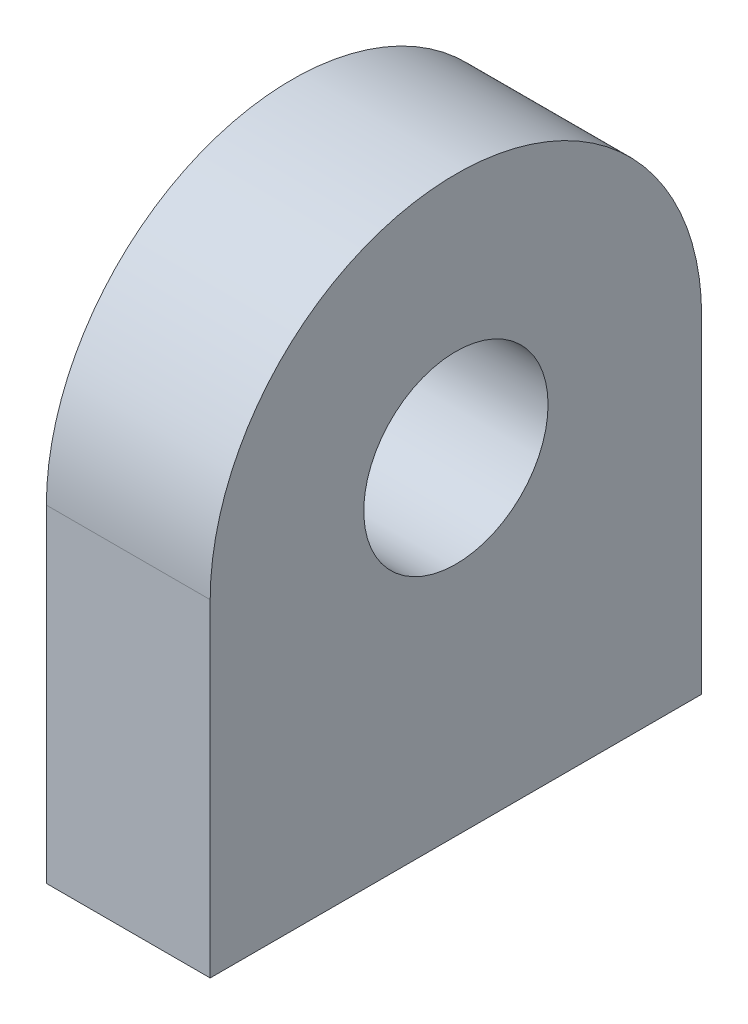
ISO-10303-21;
HEADER;
FILE_DESCRIPTION(('STEP AP214'),'2;1');
FILE_NAME('part.step','',(''),(''),'','','');
FILE_SCHEMA(('AUTOMOTIVE_DESIGN { 1 0 10303 214 1 1 1 1 }'));
ENDSEC;
DATA;
#1=APPLICATION_CONTEXT('core data for automotive mechanical design processes');
#2=APPLICATION_PROTOCOL_DEFINITION('international standard','automotive_design',2000,#1);
#3=PRODUCT_CONTEXT('',#1,'mechanical');
#4=PRODUCT('Part','Part','',(#3));
#5=PRODUCT_RELATED_PRODUCT_CATEGORY('part','',(#4));
#6=PRODUCT_DEFINITION_FORMATION('','',#4);
#7=PRODUCT_DEFINITION_CONTEXT('part definition',#1,'design');
#8=PRODUCT_DEFINITION('design','',#6,#7);
#9=PRODUCT_DEFINITION_SHAPE('','',#8);
#10=(LENGTH_UNIT() NAMED_UNIT(*) SI_UNIT(.MILLI.,.METRE.));
#11=(NAMED_UNIT(*) PLANE_ANGLE_UNIT() SI_UNIT($,.RADIAN.));
#12=(NAMED_UNIT(*) SI_UNIT($,.STERADIAN.) SOLID_ANGLE_UNIT());
#13=UNCERTAINTY_MEASURE_WITH_UNIT(LENGTH_MEASURE(1.E-05),#10,'distance_accuracy_value','');
#14=(GEOMETRIC_REPRESENTATION_CONTEXT(3) GLOBAL_UNCERTAINTY_ASSIGNED_CONTEXT((#13)) GLOBAL_UNIT_ASSIGNED_CONTEXT((#10,
#11,#12)) REPRESENTATION_CONTEXT('',''));
#15=CARTESIAN_POINT('',(0.,0.,0.));
#16=DIRECTION('',(0.,0.,1.));
#17=DIRECTION('',(1.,0.,0.));
#18=AXIS2_PLACEMENT_3D('',#15,#16,#17);
#19=CARTESIAN_POINT('',(12.7,50.8,0.));
#20=DIRECTION('',(-1.,0.,0.));
#21=DIRECTION('',(0.,0.,1.));
#22=AXIS2_PLACEMENT_3D('',#19,#20,#21);
#23=PLANE('',#22);
#24=DIRECTION('',(0.,-1.,0.));
#25=VECTOR('',#24,1.);
#26=CARTESIAN_POINT('',(12.7,0.,38.1));
#27=LINE('',#26,#25);
#28=CARTESIAN_POINT('',(12.7,50.8,38.1));
#29=VERTEX_POINT('',#28);
#30=CARTESIAN_POINT('',(12.7,0.,38.1));
#31=VERTEX_POINT('',#30);
#32=EDGE_CURVE('E85',#29,#31,#27,.T.);
#33=ORIENTED_EDGE('',*,*,#32,.T.);
#34=DIRECTION('',(0.,0.,-1.));
#35=VECTOR('',#34,1.);
#36=CARTESIAN_POINT('',(12.7,0.,38.1));
#37=LINE('',#36,#35);
#38=CARTESIAN_POINT('',(12.7,0.,-38.1));
#39=VERTEX_POINT('',#38);
#40=EDGE_CURVE('E80',#31,#39,#37,.T.);
#41=ORIENTED_EDGE('',*,*,#40,.T.);
#42=DIRECTION('',(0.,1.,0.));
#43=VECTOR('',#42,1.);
#44=CARTESIAN_POINT('',(12.7,0.,-38.1));
#45=LINE('',#44,#43);
#46=CARTESIAN_POINT('',(12.7,50.8,-38.1));
#47=VERTEX_POINT('',#46);
#48=EDGE_CURVE('E83',#39,#47,#45,.T.);
#49=ORIENTED_EDGE('',*,*,#48,.T.);
#50=CARTESIAN_POINT('',(12.7,50.8,0.));
#51=DIRECTION('',(1.,0.,0.));
#52=DIRECTION('',(0.,0.,1.));
#53=AXIS2_PLACEMENT_3D('',#50,#51,#52);
#54=CIRCLE('',#53,38.1);
#55=EDGE_CURVE('E50',#47,#29,#54,.T.);
#56=ORIENTED_EDGE('',*,*,#55,.T.);
#57=EDGE_LOOP('',(#33,#41,#49,#56));
#58=FACE_BOUND('',#57,.T.);
#59=CARTESIAN_POINT('',(12.7,50.8,0.));
#60=DIRECTION('',(1.,0.,0.));
#61=DIRECTION('',(0.,0.,-1.));
#62=AXIS2_PLACEMENT_3D('',#59,#60,#61);
#63=CIRCLE('',#62,14.2875);
#64=CARTESIAN_POINT('',(12.7,50.8,-14.2875));
#65=VERTEX_POINT('',#64);
#66=EDGE_CURVE('E100',#65,#65,#63,.T.);
#67=ORIENTED_EDGE('',*,*,#66,.F.);
#68=EDGE_LOOP('',(#67));
#69=FACE_BOUND('',#68,.T.);
#70=ADVANCED_FACE('F33',(#58,#69),#23,.F.);
#71=CARTESIAN_POINT('',(-12.7,50.8,0.));
#72=DIRECTION('',(-1.,0.,0.));
#73=DIRECTION('',(0.,0.,1.));
#74=AXIS2_PLACEMENT_3D('',#71,#72,#73);
#75=PLANE('',#74);
#76=DIRECTION('',(0.,-1.,0.));
#77=VECTOR('',#76,1.);
#78=CARTESIAN_POINT('',(-12.7,0.,38.1));
#79=LINE('',#78,#77);
#80=CARTESIAN_POINT('',(-12.7,50.8,38.1));
#81=VERTEX_POINT('',#80);
#82=CARTESIAN_POINT('',(-12.7,0.,38.1));
#83=VERTEX_POINT('',#82);
#84=EDGE_CURVE('E97',#81,#83,#79,.T.);
#85=ORIENTED_EDGE('',*,*,#84,.F.);
#86=CARTESIAN_POINT('',(-12.7,50.8,0.));
#87=DIRECTION('',(1.,0.,0.));
#88=DIRECTION('',(0.,0.,1.));
#89=AXIS2_PLACEMENT_3D('',#86,#87,#88);
#90=CIRCLE('',#89,38.1);
#91=CARTESIAN_POINT('',(-12.7,50.8,-38.1));
#92=VERTEX_POINT('',#91);
#93=EDGE_CURVE('E73',#92,#81,#90,.T.);
#94=ORIENTED_EDGE('',*,*,#93,.F.);
#95=DIRECTION('',(0.,1.,0.));
#96=VECTOR('',#95,1.);
#97=CARTESIAN_POINT('',(-12.7,0.,-38.1));
#98=LINE('',#97,#96);
#99=CARTESIAN_POINT('',(-12.7,0.,-38.1));
#100=VERTEX_POINT('',#99);
#101=EDGE_CURVE('E67',#100,#92,#98,.T.);
#102=ORIENTED_EDGE('',*,*,#101,.F.);
#103=DIRECTION('',(0.,0.,-1.));
#104=VECTOR('',#103,1.);
#105=CARTESIAN_POINT('',(-12.7,0.,38.1));
#106=LINE('',#105,#104);
#107=EDGE_CURVE('E89',#83,#100,#106,.T.);
#108=ORIENTED_EDGE('',*,*,#107,.F.);
#109=EDGE_LOOP('',(#85,#94,#102,#108));
#110=FACE_BOUND('',#109,.T.);
#111=CARTESIAN_POINT('',(-12.7,50.8,0.));
#112=DIRECTION('',(1.,0.,0.));
#113=DIRECTION('',(0.,0.,-1.));
#114=AXIS2_PLACEMENT_3D('',#111,#112,#113);
#115=CIRCLE('',#114,14.2875);
#116=CARTESIAN_POINT('',(-12.7,50.8,-14.2875));
#117=VERTEX_POINT('',#116);
#118=EDGE_CURVE('E112',#117,#117,#115,.T.);
#119=ORIENTED_EDGE('',*,*,#118,.T.);
#120=EDGE_LOOP('',(#119));
#121=FACE_BOUND('',#120,.T.);
#122=ADVANCED_FACE('F108',(#110,#121),#75,.T.);
#123=CARTESIAN_POINT('',(12.7,0.,38.1));
#124=DIRECTION('',(0.,0.,-1.));
#125=DIRECTION('',(-1.,0.,0.));
#126=AXIS2_PLACEMENT_3D('',#123,#124,#125);
#127=PLANE('',#126);
#128=ORIENTED_EDGE('',*,*,#84,.T.);
#129=DIRECTION('',(-1.,0.,0.));
#130=VECTOR('',#129,1.);
#131=CARTESIAN_POINT('',(12.7,0.,38.1));
#132=LINE('',#131,#130);
#133=EDGE_CURVE('E11',#31,#83,#132,.T.);
#134=ORIENTED_EDGE('',*,*,#133,.F.);
#135=ORIENTED_EDGE('',*,*,#32,.F.);
#136=DIRECTION('',(-1.,0.,0.));
#137=VECTOR('',#136,1.);
#138=CARTESIAN_POINT('',(12.7,50.8,38.1));
#139=LINE('',#138,#137);
#140=EDGE_CURVE('E93',#29,#81,#139,.T.);
#141=ORIENTED_EDGE('',*,*,#140,.T.);
#142=EDGE_LOOP('',(#128,#134,#135,#141));
#143=FACE_BOUND('',#142,.T.);
#144=ADVANCED_FACE('F35',(#143),#127,.F.);
#145=CARTESIAN_POINT('',(12.7,0.,38.1));
#146=DIRECTION('',(0.,1.,0.));
#147=DIRECTION('',(0.,0.,1.));
#148=AXIS2_PLACEMENT_3D('',#145,#146,#147);
#149=PLANE('',#148);
#150=ORIENTED_EDGE('',*,*,#107,.T.);
#151=DIRECTION('',(-1.,0.,0.));
#152=VECTOR('',#151,1.);
#153=CARTESIAN_POINT('',(12.7,0.,-38.1));
#154=LINE('',#153,#152);
#155=EDGE_CURVE('E42',#39,#100,#154,.T.);
#156=ORIENTED_EDGE('',*,*,#155,.F.);
#157=ORIENTED_EDGE('',*,*,#40,.F.);
#158=ORIENTED_EDGE('',*,*,#133,.T.);
#159=EDGE_LOOP('',(#150,#156,#157,#158));
#160=FACE_BOUND('',#159,.T.);
#161=ADVANCED_FACE('F88',(#160),#149,.F.);
#162=CARTESIAN_POINT('',(12.7,0.,-38.1));
#163=DIRECTION('',(0.,0.,1.));
#164=DIRECTION('',(1.,0.,0.));
#165=AXIS2_PLACEMENT_3D('',#162,#163,#164);
#166=PLANE('',#165);
#167=ORIENTED_EDGE('',*,*,#101,.T.);
#168=DIRECTION('',(-1.,0.,0.));
#169=VECTOR('',#168,1.);
#170=CARTESIAN_POINT('',(12.7,50.8,-38.1));
#171=LINE('',#170,#169);
#172=EDGE_CURVE('E90',#47,#92,#171,.T.);
#173=ORIENTED_EDGE('',*,*,#172,.F.);
#174=ORIENTED_EDGE('',*,*,#48,.F.);
#175=ORIENTED_EDGE('',*,*,#155,.T.);
#176=EDGE_LOOP('',(#167,#173,#174,#175));
#177=FACE_BOUND('',#176,.T.);
#178=ADVANCED_FACE('F91',(#177),#166,.F.);
#179=CARTESIAN_POINT('',(12.7,50.8,0.));
#180=DIRECTION('',(-1.,0.,0.));
#181=DIRECTION('',(0.,0.,1.));
#182=AXIS2_PLACEMENT_3D('',#179,#180,#181);
#183=CYLINDRICAL_SURFACE('',#182,38.1);
#184=ORIENTED_EDGE('',*,*,#93,.T.);
#185=ORIENTED_EDGE('',*,*,#140,.F.);
#186=ORIENTED_EDGE('',*,*,#55,.F.);
#187=ORIENTED_EDGE('',*,*,#172,.T.);
#188=EDGE_LOOP('',(#184,#185,#186,#187));
#189=FACE_BOUND('',#188,.T.);
#190=ADVANCED_FACE('F105',(#189),#183,.T.);
#191=CARTESIAN_POINT('',(12.7,50.8,0.));
#192=DIRECTION('',(-1.,0.,0.));
#193=DIRECTION('',(0.,0.,1.));
#194=AXIS2_PLACEMENT_3D('',#191,#192,#193);
#195=CYLINDRICAL_SURFACE('',#194,14.2875);
#196=ORIENTED_EDGE('',*,*,#66,.T.);
#197=EDGE_LOOP('',(#196));
#198=FACE_BOUND('',#197,.T.);
#199=ORIENTED_EDGE('',*,*,#118,.F.);
#200=EDGE_LOOP('',(#199));
#201=FACE_BOUND('',#200,.T.);
#202=ADVANCED_FACE('F118',(#198,#201),#195,.F.);
#203=CLOSED_SHELL('',(#70,#122,#144,#161,#178,#190,#202));
#204=MANIFOLD_SOLID_BREP('B2',#203);
#205=ADVANCED_BREP_SHAPE_REPRESENTATION('',(#18,#204),#14);
#206=SHAPE_DEFINITION_REPRESENTATION(#9,#205);
ENDSEC;
END-ISO-10303-21;
